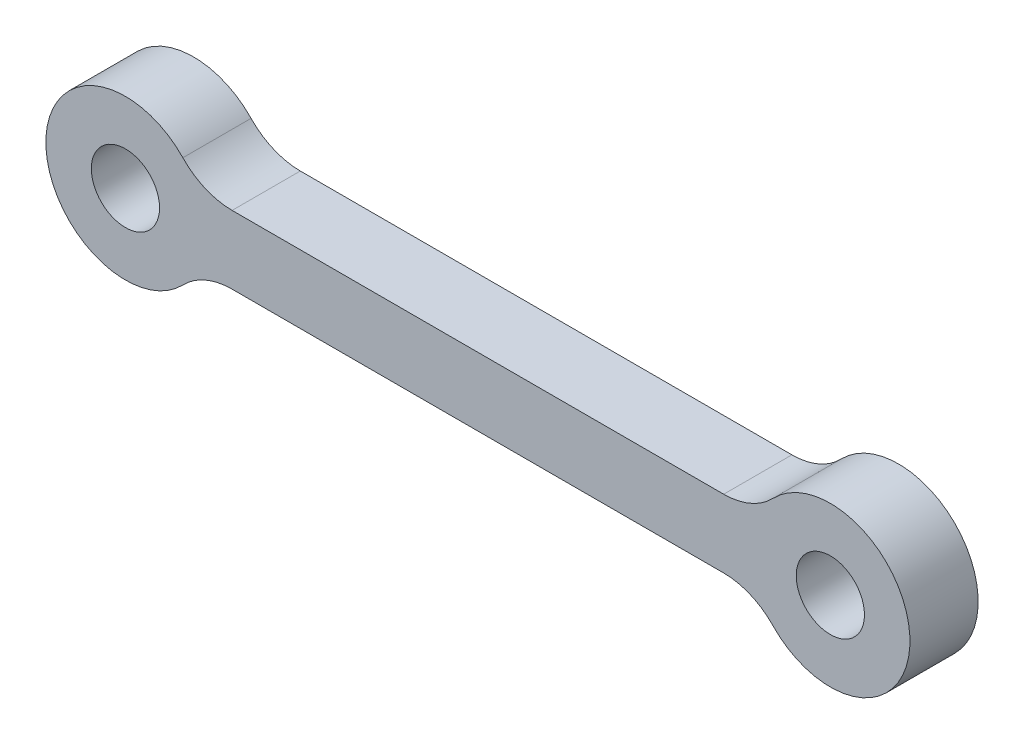
ISO-10303-21;
HEADER;
FILE_DESCRIPTION(('STEP AP214'),'2;1');
FILE_NAME('part.step','',(''),(''),'','','');
FILE_SCHEMA(('AUTOMOTIVE_DESIGN { 1 0 10303 214 1 1 1 1 }'));
ENDSEC;
DATA;
#1=APPLICATION_CONTEXT('core data for automotive mechanical design processes');
#2=APPLICATION_PROTOCOL_DEFINITION('international standard','automotive_design',2000,#1);
#3=PRODUCT_CONTEXT('',#1,'mechanical');
#4=PRODUCT('Part','Part','',(#3));
#5=PRODUCT_RELATED_PRODUCT_CATEGORY('part','',(#4));
#6=PRODUCT_DEFINITION_FORMATION('','',#4);
#7=PRODUCT_DEFINITION_CONTEXT('part definition',#1,'design');
#8=PRODUCT_DEFINITION('design','',#6,#7);
#9=PRODUCT_DEFINITION_SHAPE('','',#8);
#10=(LENGTH_UNIT() NAMED_UNIT(*) SI_UNIT(.MILLI.,.METRE.));
#11=(NAMED_UNIT(*) PLANE_ANGLE_UNIT() SI_UNIT($,.RADIAN.));
#12=(NAMED_UNIT(*) SI_UNIT($,.STERADIAN.) SOLID_ANGLE_UNIT());
#13=UNCERTAINTY_MEASURE_WITH_UNIT(LENGTH_MEASURE(1.E-05),#10,'distance_accuracy_value','');
#14=(GEOMETRIC_REPRESENTATION_CONTEXT(3) GLOBAL_UNCERTAINTY_ASSIGNED_CONTEXT((#13)) GLOBAL_UNIT_ASSIGNED_CONTEXT((#10,
#11,#12)) REPRESENTATION_CONTEXT('',''));
#15=CARTESIAN_POINT('',(0.,0.,0.));
#16=DIRECTION('',(0.,0.,1.));
#17=DIRECTION('',(1.,0.,0.));
#18=AXIS2_PLACEMENT_3D('',#15,#16,#17);
#19=CARTESIAN_POINT('',(-15.5,0.,1.5));
#20=DIRECTION('',(0.,0.,-1.));
#21=DIRECTION('',(-1.,0.,0.));
#22=AXIS2_PLACEMENT_3D('',#19,#20,#21);
#23=CYLINDRICAL_SURFACE('',#22,3.5);
#24=CARTESIAN_POINT('',(-15.5,0.,1.5));
#25=DIRECTION('',(0.,0.,1.));
#26=DIRECTION('',(1.,0.,0.));
#27=AXIS2_PLACEMENT_3D('',#24,#25,#26);
#28=CIRCLE('',#27,3.5);
#29=CARTESIAN_POINT('',(-12.9743915139412,2.42307692307692,1.5));
#30=VERTEX_POINT('',#29);
#31=CARTESIAN_POINT('',(-12.9743915139412,-2.42307692307692,1.5));
#32=VERTEX_POINT('',#31);
#33=EDGE_CURVE('E168',#30,#32,#28,.T.);
#34=ORIENTED_EDGE('',*,*,#33,.F.);
#35=DIRECTION('',(0.,0.,-1.));
#36=VECTOR('',#35,1.);
#37=CARTESIAN_POINT('',(-12.9743915139412,2.42307692307692,1.5));
#38=LINE('',#37,#36);
#39=CARTESIAN_POINT('',(-12.9743915139412,2.42307692307692,-1.5));
#40=VERTEX_POINT('',#39);
#41=EDGE_CURVE('E109',#30,#40,#38,.T.);
#42=ORIENTED_EDGE('',*,*,#41,.T.);
#43=CARTESIAN_POINT('',(-15.5,0.,-1.5));
#44=DIRECTION('',(0.,0.,1.));
#45=DIRECTION('',(1.,0.,0.));
#46=AXIS2_PLACEMENT_3D('',#43,#44,#45);
#47=CIRCLE('',#46,3.5);
#48=CARTESIAN_POINT('',(-12.9743915139412,-2.42307692307692,-1.5));
#49=VERTEX_POINT('',#48);
#50=EDGE_CURVE('E132',#40,#49,#47,.T.);
#51=ORIENTED_EDGE('',*,*,#50,.T.);
#52=DIRECTION('',(0.,0.,-1.));
#53=VECTOR('',#52,1.);
#54=CARTESIAN_POINT('',(-12.9743915139412,-2.42307692307693,1.5));
#55=LINE('',#54,#53);
#56=EDGE_CURVE('E47',#49,#32,#55,.F.);
#57=ORIENTED_EDGE('',*,*,#56,.T.);
#58=EDGE_LOOP('',(#34,#42,#51,#57));
#59=FACE_BOUND('',#58,.T.);
#60=ADVANCED_FACE('F32',(#59),#23,.T.);
#61=CARTESIAN_POINT('',(0.,-1.5,1.5));
#62=DIRECTION('',(0.,1.,0.));
#63=DIRECTION('',(-1.,0.,0.));
#64=AXIS2_PLACEMENT_3D('',#61,#62,#63);
#65=PLANE('',#64);
#66=DIRECTION('',(1.,0.,0.));
#67=VECTOR('',#66,1.);
#68=CARTESIAN_POINT('',(0.,-1.5,-1.5));
#69=LINE('',#68,#67);
#70=CARTESIAN_POINT('',(-10.8095842401766,-1.50000000000001,-1.5));
#71=VERTEX_POINT('',#70);
#72=CARTESIAN_POINT('',(10.8095842401766,-1.49999999999999,-1.5));
#73=VERTEX_POINT('',#72);
#74=EDGE_CURVE('E128',#71,#73,#69,.T.);
#75=ORIENTED_EDGE('',*,*,#74,.T.);
#76=DIRECTION('',(0.,0.,1.));
#77=VECTOR('',#76,1.);
#78=CARTESIAN_POINT('',(10.8095842401766,-1.49999999999999,1.5));
#79=LINE('',#78,#77);
#80=CARTESIAN_POINT('',(10.8095842401766,-1.49999999999999,1.5));
#81=VERTEX_POINT('',#80);
#82=EDGE_CURVE('E103',#73,#81,#79,.T.);
#83=ORIENTED_EDGE('',*,*,#82,.T.);
#84=DIRECTION('',(1.,0.,0.));
#85=VECTOR('',#84,1.);
#86=CARTESIAN_POINT('',(0.,-1.5,1.5));
#87=LINE('',#86,#85);
#88=CARTESIAN_POINT('',(-10.8095842401766,-1.50000000000001,1.5));
#89=VERTEX_POINT('',#88);
#90=EDGE_CURVE('E167',#89,#81,#87,.T.);
#91=ORIENTED_EDGE('',*,*,#90,.F.);
#92=DIRECTION('',(0.,0.,1.));
#93=VECTOR('',#92,1.);
#94=CARTESIAN_POINT('',(-10.8095842401766,-1.50000000000001,-1.5));
#95=LINE('',#94,#93);
#96=EDGE_CURVE('E119',#89,#71,#95,.F.);
#97=ORIENTED_EDGE('',*,*,#96,.T.);
#98=EDGE_LOOP('',(#75,#83,#91,#97));
#99=FACE_BOUND('',#98,.T.);
#100=ADVANCED_FACE('F170',(#99),#65,.F.);
#101=CARTESIAN_POINT('',(15.5,0.,1.5));
#102=DIRECTION('',(0.,0.,-1.));
#103=DIRECTION('',(-1.,0.,0.));
#104=AXIS2_PLACEMENT_3D('',#101,#102,#103);
#105=CYLINDRICAL_SURFACE('',#104,3.5);
#106=CARTESIAN_POINT('',(15.5,0.,1.5));
#107=DIRECTION('',(0.,0.,1.));
#108=DIRECTION('',(1.,0.,0.));
#109=AXIS2_PLACEMENT_3D('',#106,#107,#108);
#110=CIRCLE('',#109,3.5);
#111=CARTESIAN_POINT('',(12.9743915139412,-2.42307692307692,1.5));
#112=VERTEX_POINT('',#111);
#113=CARTESIAN_POINT('',(12.9743915139412,2.42307692307692,1.5));
#114=VERTEX_POINT('',#113);
#115=EDGE_CURVE('E118',#112,#114,#110,.T.);
#116=ORIENTED_EDGE('',*,*,#115,.F.);
#117=DIRECTION('',(0.,0.,-1.));
#118=VECTOR('',#117,1.);
#119=CARTESIAN_POINT('',(12.9743915139412,-2.42307692307692,1.5));
#120=LINE('',#119,#118);
#121=CARTESIAN_POINT('',(12.9743915139412,-2.42307692307692,-1.5));
#122=VERTEX_POINT('',#121);
#123=EDGE_CURVE('E102',#112,#122,#120,.T.);
#124=ORIENTED_EDGE('',*,*,#123,.T.);
#125=CARTESIAN_POINT('',(15.5,0.,-1.5));
#126=DIRECTION('',(0.,0.,1.));
#127=DIRECTION('',(1.,0.,0.));
#128=AXIS2_PLACEMENT_3D('',#125,#126,#127);
#129=CIRCLE('',#128,3.5);
#130=CARTESIAN_POINT('',(12.9743915139412,2.42307692307692,-1.5));
#131=VERTEX_POINT('',#130);
#132=EDGE_CURVE('E115',#122,#131,#129,.T.);
#133=ORIENTED_EDGE('',*,*,#132,.T.);
#134=DIRECTION('',(0.,0.,-1.));
#135=VECTOR('',#134,1.);
#136=CARTESIAN_POINT('',(12.9743915139412,2.42307692307692,1.5));
#137=LINE('',#136,#135);
#138=EDGE_CURVE('E120',#131,#114,#137,.F.);
#139=ORIENTED_EDGE('',*,*,#138,.T.);
#140=EDGE_LOOP('',(#116,#124,#133,#139));
#141=FACE_BOUND('',#140,.T.);
#142=ADVANCED_FACE('F114',(#141),#105,.T.);
#143=CARTESIAN_POINT('',(0.,1.49999999999999,1.5));
#144=DIRECTION('',(0.,1.,0.));
#145=DIRECTION('',(-1.,0.,0.));
#146=AXIS2_PLACEMENT_3D('',#143,#144,#145);
#147=PLANE('',#146);
#148=DIRECTION('',(1.,0.,0.));
#149=VECTOR('',#148,1.);
#150=CARTESIAN_POINT('',(0.,1.49999999999999,1.5));
#151=LINE('',#150,#149);
#152=CARTESIAN_POINT('',(-10.8095842401766,1.49999999999999,1.5));
#153=VERTEX_POINT('',#152);
#154=CARTESIAN_POINT('',(10.8095842401766,1.49999999999999,1.5));
#155=VERTEX_POINT('',#154);
#156=EDGE_CURVE('E172',#153,#155,#151,.T.);
#157=ORIENTED_EDGE('',*,*,#156,.T.);
#158=DIRECTION('',(0.,0.,-1.));
#159=VECTOR('',#158,1.);
#160=CARTESIAN_POINT('',(10.8095842401766,1.49999999999999,1.5));
#161=LINE('',#160,#159);
#162=CARTESIAN_POINT('',(10.8095842401766,1.49999999999999,-1.5));
#163=VERTEX_POINT('',#162);
#164=EDGE_CURVE('E146',#155,#163,#161,.T.);
#165=ORIENTED_EDGE('',*,*,#164,.T.);
#166=DIRECTION('',(1.,0.,0.));
#167=VECTOR('',#166,1.);
#168=CARTESIAN_POINT('',(0.,1.49999999999999,-1.5));
#169=LINE('',#168,#167);
#170=CARTESIAN_POINT('',(-10.8095842401766,1.49999999999999,-1.5));
#171=VERTEX_POINT('',#170);
#172=EDGE_CURVE('E127',#171,#163,#169,.T.);
#173=ORIENTED_EDGE('',*,*,#172,.F.);
#174=DIRECTION('',(0.,0.,-1.));
#175=VECTOR('',#174,1.);
#176=CARTESIAN_POINT('',(-10.8095842401766,1.49999999999999,1.5));
#177=LINE('',#176,#175);
#178=EDGE_CURVE('E144',#171,#153,#177,.F.);
#179=ORIENTED_EDGE('',*,*,#178,.T.);
#180=EDGE_LOOP('',(#157,#165,#173,#179));
#181=FACE_BOUND('',#180,.T.);
#182=ADVANCED_FACE('F188',(#181),#147,.T.);
#183=CARTESIAN_POINT('',(-15.5,0.,1.5));
#184=DIRECTION('',(0.,0.,-1.));
#185=DIRECTION('',(-1.,0.,0.));
#186=AXIS2_PLACEMENT_3D('',#183,#184,#185);
#187=CYLINDRICAL_SURFACE('',#186,1.5);
#188=CARTESIAN_POINT('',(-15.5,0.,1.5));
#189=DIRECTION('',(0.,0.,1.));
#190=DIRECTION('',(1.,0.,0.));
#191=AXIS2_PLACEMENT_3D('',#188,#189,#190);
#192=CIRCLE('',#191,1.5);
#193=CARTESIAN_POINT('',(-14.,0.,1.5));
#194=VERTEX_POINT('',#193);
#195=EDGE_CURVE('E138',#194,#194,#192,.T.);
#196=ORIENTED_EDGE('',*,*,#195,.T.);
#197=EDGE_LOOP('',(#196));
#198=FACE_BOUND('',#197,.T.);
#199=CARTESIAN_POINT('',(-15.5,0.,-1.5));
#200=DIRECTION('',(0.,0.,1.));
#201=DIRECTION('',(1.,0.,0.));
#202=AXIS2_PLACEMENT_3D('',#199,#200,#201);
#203=CIRCLE('',#202,1.5);
#204=CARTESIAN_POINT('',(-14.,0.,-1.5));
#205=VERTEX_POINT('',#204);
#206=EDGE_CURVE('E161',#205,#205,#203,.T.);
#207=ORIENTED_EDGE('',*,*,#206,.F.);
#208=EDGE_LOOP('',(#207));
#209=FACE_BOUND('',#208,.T.);
#210=ADVANCED_FACE('F185',(#198,#209),#187,.F.);
#211=CARTESIAN_POINT('',(15.5,0.,1.5));
#212=DIRECTION('',(0.,0.,-1.));
#213=DIRECTION('',(-1.,0.,0.));
#214=AXIS2_PLACEMENT_3D('',#211,#212,#213);
#215=CYLINDRICAL_SURFACE('',#214,1.5);
#216=CARTESIAN_POINT('',(15.5,0.,1.5));
#217=DIRECTION('',(0.,0.,1.));
#218=DIRECTION('',(1.,0.,0.));
#219=AXIS2_PLACEMENT_3D('',#216,#217,#218);
#220=CIRCLE('',#219,1.5);
#221=CARTESIAN_POINT('',(17.,0.,1.5));
#222=VERTEX_POINT('',#221);
#223=EDGE_CURVE('E139',#222,#222,#220,.T.);
#224=ORIENTED_EDGE('',*,*,#223,.T.);
#225=EDGE_LOOP('',(#224));
#226=FACE_BOUND('',#225,.T.);
#227=CARTESIAN_POINT('',(15.5,0.,-1.5));
#228=DIRECTION('',(0.,0.,1.));
#229=DIRECTION('',(1.,0.,0.));
#230=AXIS2_PLACEMENT_3D('',#227,#228,#229);
#231=CIRCLE('',#230,1.5);
#232=CARTESIAN_POINT('',(17.,0.,-1.5));
#233=VERTEX_POINT('',#232);
#234=EDGE_CURVE('E130',#233,#233,#231,.T.);
#235=ORIENTED_EDGE('',*,*,#234,.F.);
#236=EDGE_LOOP('',(#235));
#237=FACE_BOUND('',#236,.T.);
#238=ADVANCED_FACE('F187',(#226,#237),#215,.F.);
#239=CARTESIAN_POINT('',(0.,0.,1.5));
#240=DIRECTION('',(0.,0.,1.));
#241=DIRECTION('',(1.,0.,0.));
#242=AXIS2_PLACEMENT_3D('',#239,#240,#241);
#243=PLANE('',#242);
#244=ORIENTED_EDGE('',*,*,#195,.F.);
#245=EDGE_LOOP('',(#244));
#246=FACE_BOUND('',#245,.T.);
#247=ORIENTED_EDGE('',*,*,#156,.F.);
#248=CARTESIAN_POINT('',(-10.8095842401766,4.49999999999999,1.5));
#249=DIRECTION('',(0.,0.,1.));
#250=DIRECTION('',(1.,0.,0.));
#251=AXIS2_PLACEMENT_3D('',#248,#249,#250);
#252=CIRCLE('',#251,3.);
#253=EDGE_CURVE('E54',#153,#30,#252,.F.);
#254=ORIENTED_EDGE('',*,*,#253,.T.);
#255=ORIENTED_EDGE('',*,*,#33,.T.);
#256=CARTESIAN_POINT('',(-10.8095842401766,-4.50000000000001,1.5));
#257=DIRECTION('',(0.,0.,1.));
#258=DIRECTION('',(1.,0.,0.));
#259=AXIS2_PLACEMENT_3D('',#256,#257,#258);
#260=CIRCLE('',#259,3.);
#261=EDGE_CURVE('E11',#32,#89,#260,.F.);
#262=ORIENTED_EDGE('',*,*,#261,.T.);
#263=ORIENTED_EDGE('',*,*,#90,.T.);
#264=CARTESIAN_POINT('',(10.8095842401766,-4.49999999999999,1.5));
#265=DIRECTION('',(0.,0.,1.));
#266=DIRECTION('',(1.,0.,0.));
#267=AXIS2_PLACEMENT_3D('',#264,#265,#266);
#268=CIRCLE('',#267,3.);
#269=EDGE_CURVE('E108',#81,#112,#268,.F.);
#270=ORIENTED_EDGE('',*,*,#269,.T.);
#271=ORIENTED_EDGE('',*,*,#115,.T.);
#272=CARTESIAN_POINT('',(10.8095842401766,4.49999999999999,1.5));
#273=DIRECTION('',(0.,0.,1.));
#274=DIRECTION('',(1.,0.,0.));
#275=AXIS2_PLACEMENT_3D('',#272,#273,#274);
#276=CIRCLE('',#275,3.);
#277=EDGE_CURVE('E154',#114,#155,#276,.F.);
#278=ORIENTED_EDGE('',*,*,#277,.T.);
#279=EDGE_LOOP('',(#247,#254,#255,#262,#263,#270,#271,#278));
#280=FACE_BOUND('',#279,.T.);
#281=ORIENTED_EDGE('',*,*,#223,.F.);
#282=EDGE_LOOP('',(#281));
#283=FACE_BOUND('',#282,.T.);
#284=ADVANCED_FACE('F165',(#246,#280,#283),#243,.T.);
#285=CARTESIAN_POINT('',(0.,0.,-1.5));
#286=DIRECTION('',(0.,0.,1.));
#287=DIRECTION('',(1.,0.,0.));
#288=AXIS2_PLACEMENT_3D('',#285,#286,#287);
#289=PLANE('',#288);
#290=ORIENTED_EDGE('',*,*,#206,.T.);
#291=EDGE_LOOP('',(#290));
#292=FACE_BOUND('',#291,.T.);
#293=ORIENTED_EDGE('',*,*,#50,.F.);
#294=CARTESIAN_POINT('',(-10.8095842401766,4.49999999999999,-1.5));
#295=DIRECTION('',(0.,0.,1.));
#296=DIRECTION('',(1.,0.,0.));
#297=AXIS2_PLACEMENT_3D('',#294,#295,#296);
#298=CIRCLE('',#297,3.);
#299=EDGE_CURVE('E156',#40,#171,#298,.T.);
#300=ORIENTED_EDGE('',*,*,#299,.T.);
#301=ORIENTED_EDGE('',*,*,#172,.T.);
#302=CARTESIAN_POINT('',(10.8095842401766,4.49999999999999,-1.5));
#303=DIRECTION('',(0.,0.,1.));
#304=DIRECTION('',(1.,0.,0.));
#305=AXIS2_PLACEMENT_3D('',#302,#303,#304);
#306=CIRCLE('',#305,3.);
#307=EDGE_CURVE('E126',#163,#131,#306,.T.);
#308=ORIENTED_EDGE('',*,*,#307,.T.);
#309=ORIENTED_EDGE('',*,*,#132,.F.);
#310=CARTESIAN_POINT('',(10.8095842401766,-4.49999999999999,-1.5));
#311=DIRECTION('',(0.,0.,1.));
#312=DIRECTION('',(1.,0.,0.));
#313=AXIS2_PLACEMENT_3D('',#310,#311,#312);
#314=CIRCLE('',#313,3.);
#315=EDGE_CURVE('E98',#122,#73,#314,.T.);
#316=ORIENTED_EDGE('',*,*,#315,.T.);
#317=ORIENTED_EDGE('',*,*,#74,.F.);
#318=CARTESIAN_POINT('',(-10.8095842401766,-4.50000000000001,-1.5));
#319=DIRECTION('',(0.,0.,1.));
#320=DIRECTION('',(1.,0.,0.));
#321=AXIS2_PLACEMENT_3D('',#318,#319,#320);
#322=CIRCLE('',#321,3.);
#323=EDGE_CURVE('E40',#71,#49,#322,.T.);
#324=ORIENTED_EDGE('',*,*,#323,.T.);
#325=EDGE_LOOP('',(#293,#300,#301,#308,#309,#316,#317,#324));
#326=FACE_BOUND('',#325,.T.);
#327=ORIENTED_EDGE('',*,*,#234,.T.);
#328=EDGE_LOOP('',(#327));
#329=FACE_BOUND('',#328,.T.);
#330=ADVANCED_FACE('F123',(#292,#326,#329),#289,.F.);
#331=CARTESIAN_POINT('',(10.8095842401766,-4.49999999999999,1.5));
#332=DIRECTION('',(0.,0.,-1.));
#333=DIRECTION('',(-1.,0.,0.));
#334=AXIS2_PLACEMENT_3D('',#331,#332,#333);
#335=CYLINDRICAL_SURFACE('',#334,3.);
#336=ORIENTED_EDGE('',*,*,#269,.F.);
#337=ORIENTED_EDGE('',*,*,#82,.F.);
#338=ORIENTED_EDGE('',*,*,#315,.F.);
#339=ORIENTED_EDGE('',*,*,#123,.F.);
#340=EDGE_LOOP('',(#336,#337,#338,#339));
#341=FACE_BOUND('',#340,.T.);
#342=ADVANCED_FACE('F101',(#341),#335,.F.);
#343=CARTESIAN_POINT('',(10.8095842401766,4.49999999999999,1.5));
#344=DIRECTION('',(0.,0.,-1.));
#345=DIRECTION('',(-1.,0.,0.));
#346=AXIS2_PLACEMENT_3D('',#343,#344,#345);
#347=CYLINDRICAL_SURFACE('',#346,3.);
#348=ORIENTED_EDGE('',*,*,#277,.F.);
#349=ORIENTED_EDGE('',*,*,#138,.F.);
#350=ORIENTED_EDGE('',*,*,#307,.F.);
#351=ORIENTED_EDGE('',*,*,#164,.F.);
#352=EDGE_LOOP('',(#348,#349,#350,#351));
#353=FACE_BOUND('',#352,.T.);
#354=ADVANCED_FACE('F230',(#353),#347,.F.);
#355=CARTESIAN_POINT('',(-10.8095842401766,4.49999999999999,1.5));
#356=DIRECTION('',(0.,0.,-1.));
#357=DIRECTION('',(-1.,0.,0.));
#358=AXIS2_PLACEMENT_3D('',#355,#356,#357);
#359=CYLINDRICAL_SURFACE('',#358,3.);
#360=ORIENTED_EDGE('',*,*,#253,.F.);
#361=ORIENTED_EDGE('',*,*,#178,.F.);
#362=ORIENTED_EDGE('',*,*,#299,.F.);
#363=ORIENTED_EDGE('',*,*,#41,.F.);
#364=EDGE_LOOP('',(#360,#361,#362,#363));
#365=FACE_BOUND('',#364,.T.);
#366=ADVANCED_FACE('F236',(#365),#359,.F.);
#367=CARTESIAN_POINT('',(-10.8095842401766,-4.50000000000001,1.5));
#368=DIRECTION('',(0.,0.,-1.));
#369=DIRECTION('',(-1.,0.,0.));
#370=AXIS2_PLACEMENT_3D('',#367,#368,#369);
#371=CYLINDRICAL_SURFACE('',#370,3.);
#372=ORIENTED_EDGE('',*,*,#261,.F.);
#373=ORIENTED_EDGE('',*,*,#56,.F.);
#374=ORIENTED_EDGE('',*,*,#323,.F.);
#375=ORIENTED_EDGE('',*,*,#96,.F.);
#376=EDGE_LOOP('',(#372,#373,#374,#375));
#377=FACE_BOUND('',#376,.T.);
#378=ADVANCED_FACE('F34',(#377),#371,.F.);
#379=CLOSED_SHELL('',(#60,#100,#142,#182,#210,#238,#284,#330,#342,#354,#366,#378));
#380=MANIFOLD_SOLID_BREP('B2',#379);
#381=ADVANCED_BREP_SHAPE_REPRESENTATION('',(#18,#380),#14);
#382=SHAPE_DEFINITION_REPRESENTATION(#9,#381);
ENDSEC;
END-ISO-10303-21;
